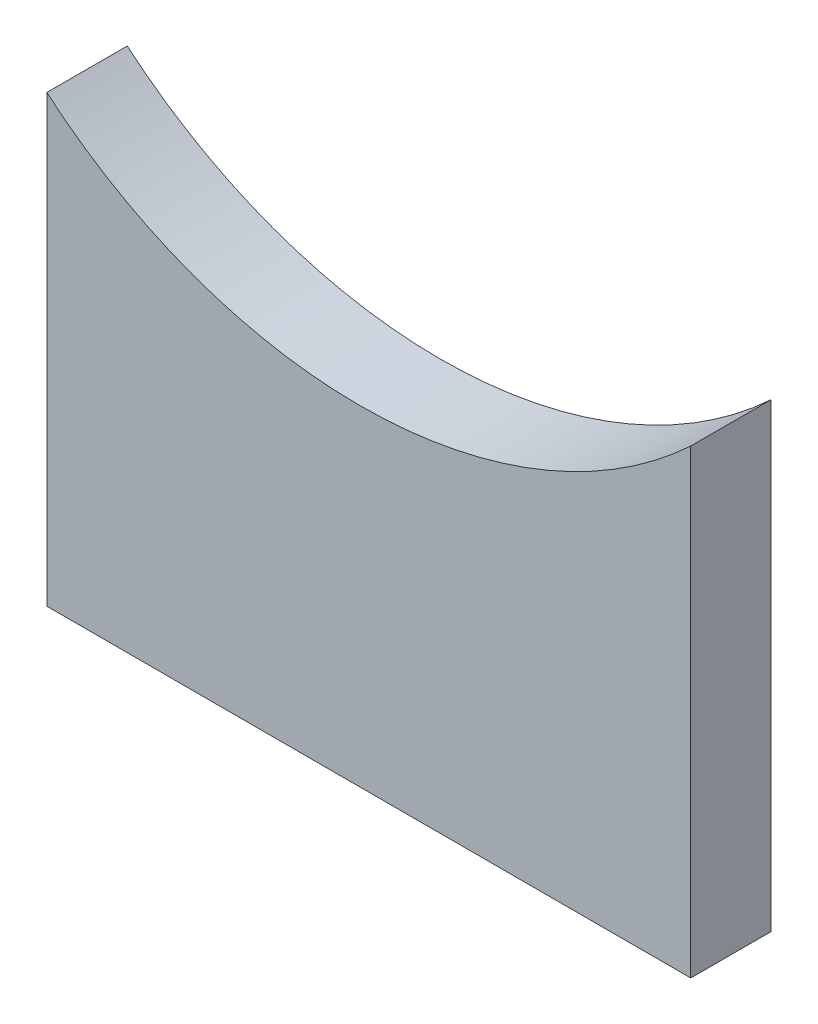
ISO-10303-21;
HEADER;
FILE_DESCRIPTION(('STEP AP214'),'2;1');
FILE_NAME('part.step','',(''),(''),'','','');
FILE_SCHEMA(('AUTOMOTIVE_DESIGN { 1 0 10303 214 1 1 1 1 }'));
ENDSEC;
DATA;
#1=APPLICATION_CONTEXT('core data for automotive mechanical design processes');
#2=APPLICATION_PROTOCOL_DEFINITION('international standard','automotive_design',2000,#1);
#3=PRODUCT_CONTEXT('',#1,'mechanical');
#4=PRODUCT('Part','Part','',(#3));
#5=PRODUCT_RELATED_PRODUCT_CATEGORY('part','',(#4));
#6=PRODUCT_DEFINITION_FORMATION('','',#4);
#7=PRODUCT_DEFINITION_CONTEXT('part definition',#1,'design');
#8=PRODUCT_DEFINITION('design','',#6,#7);
#9=PRODUCT_DEFINITION_SHAPE('','',#8);
#10=(LENGTH_UNIT() NAMED_UNIT(*) SI_UNIT(.MILLI.,.METRE.));
#11=(NAMED_UNIT(*) PLANE_ANGLE_UNIT() SI_UNIT($,.RADIAN.));
#12=(NAMED_UNIT(*) SI_UNIT($,.STERADIAN.) SOLID_ANGLE_UNIT());
#13=UNCERTAINTY_MEASURE_WITH_UNIT(LENGTH_MEASURE(1.E-05),#10,'distance_accuracy_value','');
#14=(GEOMETRIC_REPRESENTATION_CONTEXT(3) GLOBAL_UNCERTAINTY_ASSIGNED_CONTEXT((#13)) GLOBAL_UNIT_ASSIGNED_CONTEXT((#10,
#11,#12)) REPRESENTATION_CONTEXT('',''));
#15=CARTESIAN_POINT('',(0.,0.,0.));
#16=DIRECTION('',(0.,0.,1.));
#17=DIRECTION('',(1.,0.,0.));
#18=AXIS2_PLACEMENT_3D('',#15,#16,#17);
#19=CARTESIAN_POINT('',(-6.29704621779584E-13,0.,2.));
#20=DIRECTION('',(1.,0.,0.));
#21=DIRECTION('',(0.,1.,0.));
#22=AXIS2_PLACEMENT_3D('',#19,#20,#21);
#23=PLANE('',#22);
#24=DIRECTION('',(0.,-1.,0.));
#25=VECTOR('',#24,1.);
#26=CARTESIAN_POINT('',(-6.29704621779584E-13,0.,2.));
#27=LINE('',#26,#25);
#28=CARTESIAN_POINT('',(-1.20563281580388E-13,16.053567689692,2.));
#29=VERTEX_POINT('',#28);
#30=CARTESIAN_POINT('',(-6.22625392466679E-13,4.99999999999808,2.));
#31=VERTEX_POINT('',#30);
#32=EDGE_CURVE('E89',#29,#31,#27,.T.);
#33=ORIENTED_EDGE('',*,*,#32,.F.);
#34=DIRECTION('',(0.,0.,-1.));
#35=VECTOR('',#34,1.);
#36=CARTESIAN_POINT('',(-1.20563281580388E-13,16.053567689692,10.));
#37=LINE('',#36,#35);
#38=CARTESIAN_POINT('',(-1.20563281580388E-13,16.053567689692,0.));
#39=VERTEX_POINT('',#38);
#40=EDGE_CURVE('E82',#29,#39,#37,.T.);
#41=ORIENTED_EDGE('',*,*,#40,.T.);
#42=DIRECTION('',(0.,-1.,0.));
#43=VECTOR('',#42,1.);
#44=CARTESIAN_POINT('',(-6.29704621779584E-13,0.,0.));
#45=LINE('',#44,#43);
#46=CARTESIAN_POINT('',(-6.22625392466679E-13,4.99999999999808,0.));
#47=VERTEX_POINT('',#46);
#48=EDGE_CURVE('E64',#39,#47,#45,.T.);
#49=ORIENTED_EDGE('',*,*,#48,.T.);
#50=DIRECTION('',(0.,0.,1.));
#51=VECTOR('',#50,1.);
#52=CARTESIAN_POINT('',(-6.22625392466679E-13,4.99999999999808,-3.));
#53=LINE('',#52,#51);
#54=EDGE_CURVE('E97',#47,#31,#53,.T.);
#55=ORIENTED_EDGE('',*,*,#54,.T.);
#56=EDGE_LOOP('',(#33,#41,#49,#55));
#57=FACE_BOUND('',#56,.T.);
#58=ADVANCED_FACE('F42',(#57),#23,.F.);
#59=CARTESIAN_POINT('',(15.9999999999994,0.,2.));
#60=DIRECTION('',(-1.,0.,0.));
#61=DIRECTION('',(0.,-1.,0.));
#62=AXIS2_PLACEMENT_3D('',#59,#60,#61);
#63=PLANE('',#62);
#64=DIRECTION('',(0.,1.,0.));
#65=VECTOR('',#64,1.);
#66=CARTESIAN_POINT('',(15.9999999999994,0.,0.));
#67=LINE('',#66,#65);
#68=CARTESIAN_POINT('',(15.9999999999994,4.99999999999808,0.));
#69=VERTEX_POINT('',#68);
#70=CARTESIAN_POINT('',(15.9999999999994,16.4463306993007,0.));
#71=VERTEX_POINT('',#70);
#72=EDGE_CURVE('E94',#69,#71,#67,.T.);
#73=ORIENTED_EDGE('',*,*,#72,.T.);
#74=DIRECTION('',(0.,0.,-1.));
#75=VECTOR('',#74,1.);
#76=CARTESIAN_POINT('',(15.9999999999994,16.4463306993007,10.));
#77=LINE('',#76,#75);
#78=CARTESIAN_POINT('',(15.9999999999994,16.4463306993007,2.));
#79=VERTEX_POINT('',#78);
#80=EDGE_CURVE('E56',#79,#71,#77,.T.);
#81=ORIENTED_EDGE('',*,*,#80,.F.);
#82=DIRECTION('',(0.,1.,0.));
#83=VECTOR('',#82,1.);
#84=CARTESIAN_POINT('',(15.9999999999994,0.,2.));
#85=LINE('',#84,#83);
#86=CARTESIAN_POINT('',(15.9999999999994,4.99999999999808,2.));
#87=VERTEX_POINT('',#86);
#88=EDGE_CURVE('E49',#87,#79,#85,.T.);
#89=ORIENTED_EDGE('',*,*,#88,.F.);
#90=DIRECTION('',(0.,0.,1.));
#91=VECTOR('',#90,1.);
#92=CARTESIAN_POINT('',(15.9999999999994,4.99999999999808,-3.));
#93=LINE('',#92,#91);
#94=EDGE_CURVE('E95',#69,#87,#93,.T.);
#95=ORIENTED_EDGE('',*,*,#94,.F.);
#96=EDGE_LOOP('',(#73,#81,#89,#95));
#97=FACE_BOUND('',#96,.T.);
#98=ADVANCED_FACE('F111',(#97),#63,.F.);
#99=CARTESIAN_POINT('',(0.,0.,2.));
#100=DIRECTION('',(0.,0.,1.));
#101=DIRECTION('',(1.,0.,0.));
#102=AXIS2_PLACEMENT_3D('',#99,#100,#101);
#103=PLANE('',#102);
#104=CARTESIAN_POINT('',(7.77887027200458,25.2581183992437,2.));
#105=DIRECTION('',(0.,0.,1.));
#106=DIRECTION('',(1.,0.,0.));
#107=AXIS2_PLACEMENT_3D('',#104,#105,#106);
#108=CIRCLE('',#107,12.0513309005017);
#109=EDGE_CURVE('E90',#29,#79,#108,.T.);
#110=ORIENTED_EDGE('',*,*,#109,.F.);
#111=ORIENTED_EDGE('',*,*,#32,.T.);
#112=DIRECTION('',(1.,0.,0.));
#113=VECTOR('',#112,1.);
#114=CARTESIAN_POINT('',(0.,4.99999999999808,2.));
#115=LINE('',#114,#113);
#116=EDGE_CURVE('E103',#31,#87,#115,.T.);
#117=ORIENTED_EDGE('',*,*,#116,.T.);
#118=ORIENTED_EDGE('',*,*,#88,.T.);
#119=EDGE_LOOP('',(#110,#111,#117,#118));
#120=FACE_BOUND('',#119,.T.);
#121=ADVANCED_FACE('F113',(#120),#103,.T.);
#122=CARTESIAN_POINT('',(0.,0.,0.));
#123=DIRECTION('',(0.,0.,1.));
#124=DIRECTION('',(1.,0.,0.));
#125=AXIS2_PLACEMENT_3D('',#122,#123,#124);
#126=PLANE('',#125);
#127=ORIENTED_EDGE('',*,*,#48,.F.);
#128=CARTESIAN_POINT('',(7.77887027200458,25.2581183992437,0.));
#129=DIRECTION('',(0.,0.,-1.));
#130=DIRECTION('',(1.,0.,0.));
#131=AXIS2_PLACEMENT_3D('',#128,#129,#130);
#132=CIRCLE('',#131,12.0513309005017);
#133=EDGE_CURVE('E80',#71,#39,#132,.T.);
#134=ORIENTED_EDGE('',*,*,#133,.F.);
#135=ORIENTED_EDGE('',*,*,#72,.F.);
#136=DIRECTION('',(1.,0.,0.));
#137=VECTOR('',#136,1.);
#138=CARTESIAN_POINT('',(0.,4.99999999999808,0.));
#139=LINE('',#138,#137);
#140=EDGE_CURVE('E11',#47,#69,#139,.T.);
#141=ORIENTED_EDGE('',*,*,#140,.F.);
#142=EDGE_LOOP('',(#127,#134,#135,#141));
#143=FACE_BOUND('',#142,.T.);
#144=ADVANCED_FACE('F93',(#143),#126,.F.);
#145=CARTESIAN_POINT('',(0.,4.99999999999808,-3.));
#146=DIRECTION('',(0.,-1.,0.));
#147=DIRECTION('',(0.,0.,-1.));
#148=AXIS2_PLACEMENT_3D('',#145,#146,#147);
#149=PLANE('',#148);
#150=ORIENTED_EDGE('',*,*,#140,.T.);
#151=ORIENTED_EDGE('',*,*,#94,.T.);
#152=ORIENTED_EDGE('',*,*,#116,.F.);
#153=ORIENTED_EDGE('',*,*,#54,.F.);
#154=EDGE_LOOP('',(#150,#151,#152,#153));
#155=FACE_BOUND('',#154,.T.);
#156=ADVANCED_FACE('F116',(#155),#149,.T.);
#157=CARTESIAN_POINT('',(7.77887027200458,25.2581183992437,10.));
#158=DIRECTION('',(0.,0.,-1.));
#159=DIRECTION('',(-1.,0.,0.));
#160=AXIS2_PLACEMENT_3D('',#157,#158,#159);
#161=CYLINDRICAL_SURFACE('',#160,12.0513309005017);
#162=ORIENTED_EDGE('',*,*,#109,.T.);
#163=ORIENTED_EDGE('',*,*,#80,.T.);
#164=ORIENTED_EDGE('',*,*,#133,.T.);
#165=ORIENTED_EDGE('',*,*,#40,.F.);
#166=EDGE_LOOP('',(#162,#163,#164,#165));
#167=FACE_BOUND('',#166,.T.);
#168=ADVANCED_FACE('F81',(#167),#161,.F.);
#169=CLOSED_SHELL('',(#58,#98,#121,#144,#156,#168));
#170=MANIFOLD_SOLID_BREP('B2',#169);
#171=ADVANCED_BREP_SHAPE_REPRESENTATION('',(#18,#170),#14);
#172=SHAPE_DEFINITION_REPRESENTATION(#9,#171);
ENDSEC;
END-ISO-10303-21;
